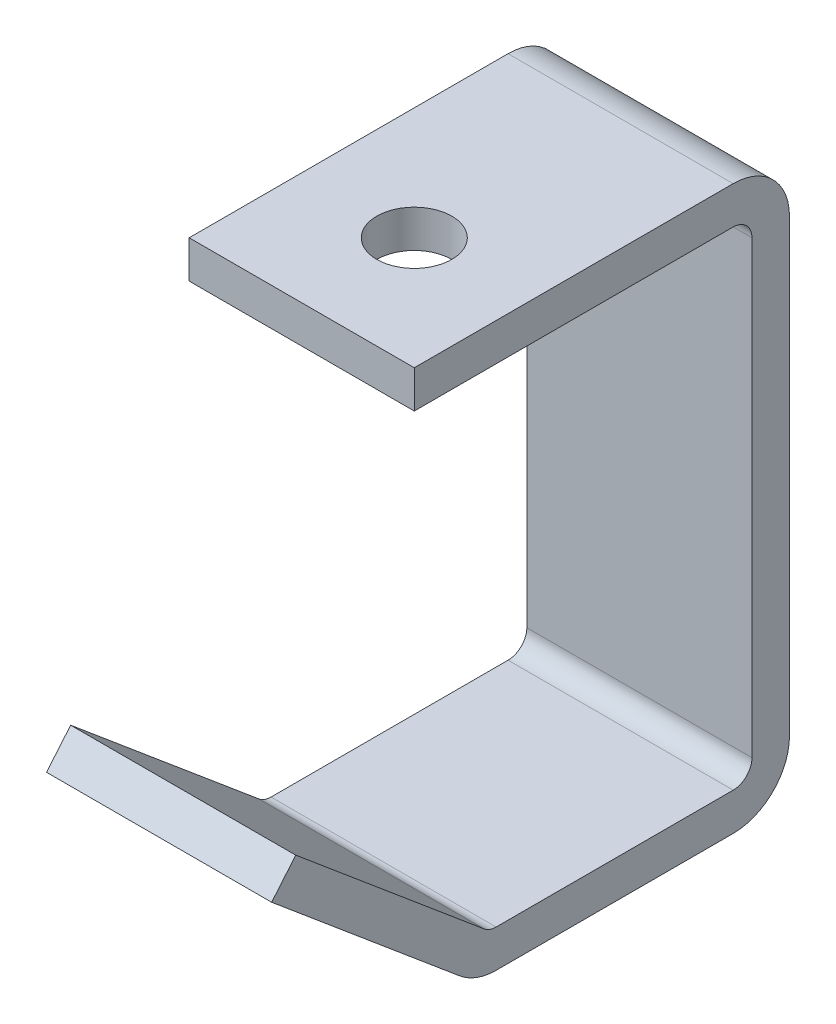
ISO-10303-21;
HEADER;
FILE_DESCRIPTION(('STEP AP214'),'2;1');
FILE_NAME('part.step','',(''),(''),'','','');
FILE_SCHEMA(('AUTOMOTIVE_DESIGN { 1 0 10303 214 1 1 1 1 }'));
ENDSEC;
DATA;
#1=APPLICATION_CONTEXT('core data for automotive mechanical design processes');
#2=APPLICATION_PROTOCOL_DEFINITION('international standard','automotive_design',2000,#1);
#3=PRODUCT_CONTEXT('',#1,'mechanical');
#4=PRODUCT('Part','Part','',(#3));
#5=PRODUCT_RELATED_PRODUCT_CATEGORY('part','',(#4));
#6=PRODUCT_DEFINITION_FORMATION('','',#4);
#7=PRODUCT_DEFINITION_CONTEXT('part definition',#1,'design');
#8=PRODUCT_DEFINITION('design','',#6,#7);
#9=PRODUCT_DEFINITION_SHAPE('','',#8);
#10=(LENGTH_UNIT() NAMED_UNIT(*) SI_UNIT(.MILLI.,.METRE.));
#11=(NAMED_UNIT(*) PLANE_ANGLE_UNIT() SI_UNIT($,.RADIAN.));
#12=(NAMED_UNIT(*) SI_UNIT($,.STERADIAN.) SOLID_ANGLE_UNIT());
#13=UNCERTAINTY_MEASURE_WITH_UNIT(LENGTH_MEASURE(1.E-05),#10,'distance_accuracy_value','');
#14=(GEOMETRIC_REPRESENTATION_CONTEXT(3) GLOBAL_UNCERTAINTY_ASSIGNED_CONTEXT((#13)) GLOBAL_UNIT_ASSIGNED_CONTEXT((#10,
#11,#12)) REPRESENTATION_CONTEXT('',''));
#15=CARTESIAN_POINT('',(0.,0.,0.));
#16=DIRECTION('',(0.,0.,1.));
#17=DIRECTION('',(1.,0.,0.));
#18=AXIS2_PLACEMENT_3D('',#15,#16,#17);
#19=CARTESIAN_POINT('',(19.05,82.55,57.15));
#20=DIRECTION('',(0.,0.,-1.));
#21=DIRECTION('',(0.,1.,0.));
#22=AXIS2_PLACEMENT_3D('',#19,#20,#21);
#23=PLANE('',#22);
#24=DIRECTION('',(-1.,0.,0.));
#25=VECTOR('',#24,1.);
#26=CARTESIAN_POINT('',(19.05,82.55,57.15));
#27=LINE('',#26,#25);
#28=CARTESIAN_POINT('',(19.05,82.55,57.15));
#29=VERTEX_POINT('',#28);
#30=CARTESIAN_POINT('',(-19.05,82.55,57.15));
#31=VERTEX_POINT('',#30);
#32=EDGE_CURVE('E168',#29,#31,#27,.T.);
#33=ORIENTED_EDGE('',*,*,#32,.F.);
#34=DIRECTION('',(0.,-1.,0.));
#35=VECTOR('',#34,1.);
#36=CARTESIAN_POINT('',(19.05,82.55,57.15));
#37=LINE('',#36,#35);
#38=CARTESIAN_POINT('',(19.05,88.9,57.15));
#39=VERTEX_POINT('',#38);
#40=EDGE_CURVE('E186',#39,#29,#37,.T.);
#41=ORIENTED_EDGE('',*,*,#40,.F.);
#42=DIRECTION('',(-1.,0.,0.));
#43=VECTOR('',#42,1.);
#44=CARTESIAN_POINT('',(19.05,88.9,57.15));
#45=LINE('',#44,#43);
#46=CARTESIAN_POINT('',(-19.05,88.9,57.15));
#47=VERTEX_POINT('',#46);
#48=EDGE_CURVE('E198',#39,#47,#45,.T.);
#49=ORIENTED_EDGE('',*,*,#48,.T.);
#50=DIRECTION('',(0.,-1.,0.));
#51=VECTOR('',#50,1.);
#52=CARTESIAN_POINT('',(-19.05,82.55,57.15));
#53=LINE('',#52,#51);
#54=EDGE_CURVE('E176',#47,#31,#53,.T.);
#55=ORIENTED_EDGE('',*,*,#54,.T.);
#56=EDGE_LOOP('',(#33,#41,#49,#55));
#57=FACE_BOUND('',#56,.T.);
#58=ADVANCED_FACE('F33',(#57),#23,.F.);
#59=CARTESIAN_POINT('',(19.05,27.488043347538,77.2089744128137));
#60=DIRECTION('',(0.,0.64278760968654,0.766044443118977));
#61=DIRECTION('',(0.,-0.766044443118977,0.64278760968654));
#62=AXIS2_PLACEMENT_3D('',#59,#60,#61);
#63=PLANE('',#62);
#64=DIRECTION('',(0.,0.766044443118977,-0.64278760968654));
#65=VECTOR('',#64,1.);
#66=CARTESIAN_POINT('',(19.05,27.488043347538,77.2089744128137));
#67=LINE('',#66,#65);
#68=CARTESIAN_POINT('',(19.05,22.6236611337325,81.2906757343232));
#69=VERTEX_POINT('',#68);
#70=CARTESIAN_POINT('',(19.05,27.488043347538,77.2089744128137));
#71=VERTEX_POINT('',#70);
#72=EDGE_CURVE('E167',#69,#71,#67,.T.);
#73=ORIENTED_EDGE('',*,*,#72,.T.);
#74=DIRECTION('',(-1.,0.,0.));
#75=VECTOR('',#74,1.);
#76=CARTESIAN_POINT('',(19.05,27.488043347538,77.2089744128137));
#77=LINE('',#76,#75);
#78=CARTESIAN_POINT('',(-19.05,27.488043347538,77.2089744128137));
#79=VERTEX_POINT('',#78);
#80=EDGE_CURVE('E152',#71,#79,#77,.T.);
#81=ORIENTED_EDGE('',*,*,#80,.T.);
#82=DIRECTION('',(0.,0.766044443118977,-0.64278760968654));
#83=VECTOR('',#82,1.);
#84=CARTESIAN_POINT('',(-19.05,27.488043347538,77.2089744128137));
#85=LINE('',#84,#83);
#86=CARTESIAN_POINT('',(-19.05,22.6236611337325,81.2906757343232));
#87=VERTEX_POINT('',#86);
#88=EDGE_CURVE('E165',#87,#79,#85,.T.);
#89=ORIENTED_EDGE('',*,*,#88,.F.);
#90=DIRECTION('',(-1.,0.,0.));
#91=VECTOR('',#90,1.);
#92=CARTESIAN_POINT('',(19.05,22.6236611337325,81.2906757343232));
#93=LINE('',#92,#91);
#94=EDGE_CURVE('E196',#69,#87,#93,.T.);
#95=ORIENTED_EDGE('',*,*,#94,.F.);
#96=EDGE_LOOP('',(#73,#81,#89,#95));
#97=FACE_BOUND('',#96,.T.);
#98=ADVANCED_FACE('F164',(#97),#63,.T.);
#99=CARTESIAN_POINT('',(19.05,0.,0.));
#100=DIRECTION('',(1.,0.,0.));
#101=DIRECTION('',(0.,0.,-1.));
#102=AXIS2_PLACEMENT_3D('',#99,#100,#101);
#103=PLANE('',#102);
#104=DIRECTION('',(0.,-0.64278760968654,-0.766044443118977));
#105=VECTOR('',#104,1.);
#106=CARTESIAN_POINT('',(19.05,22.6236611337325,81.2906757343232));
#107=LINE('',#106,#105);
#108=CARTESIAN_POINT('',(19.05,-4.12157332070826,49.4169464884691));
#109=VERTEX_POINT('',#108);
#110=EDGE_CURVE('E187',#69,#109,#107,.T.);
#111=ORIENTED_EDGE('',*,*,#110,.T.);
#112=CARTESIAN_POINT('',(19.05,3.175,43.2943945062048));
#113=DIRECTION('',(1.,0.,0.));
#114=DIRECTION('',(0.,0.,-1.));
#115=AXIS2_PLACEMENT_3D('',#112,#113,#114);
#116=CIRCLE('',#115,9.525);
#117=CARTESIAN_POINT('',(19.05,-6.35,43.2943945062048));
#118=VERTEX_POINT('',#117);
#119=EDGE_CURVE('E249',#109,#118,#116,.T.);
#120=ORIENTED_EDGE('',*,*,#119,.T.);
#121=DIRECTION('',(0.,0.,-1.));
#122=VECTOR('',#121,1.);
#123=CARTESIAN_POINT('',(19.05,-6.35,44.45));
#124=LINE('',#123,#122);
#125=CARTESIAN_POINT('',(19.05,-6.35,3.175));
#126=VERTEX_POINT('',#125);
#127=EDGE_CURVE('E201',#118,#126,#124,.T.);
#128=ORIENTED_EDGE('',*,*,#127,.T.);
#129=CARTESIAN_POINT('',(19.05,3.17500000000001,3.175));
#130=DIRECTION('',(1.,0.,0.));
#131=DIRECTION('',(0.,0.,-1.));
#132=AXIS2_PLACEMENT_3D('',#129,#130,#131);
#133=CIRCLE('',#132,9.525);
#134=CARTESIAN_POINT('',(19.05,3.17500000000001,-6.35));
#135=VERTEX_POINT('',#134);
#136=EDGE_CURVE('E54',#126,#135,#133,.T.);
#137=ORIENTED_EDGE('',*,*,#136,.T.);
#138=DIRECTION('',(0.,-1.,0.));
#139=VECTOR('',#138,1.);
#140=CARTESIAN_POINT('',(19.05,82.55,-6.35));
#141=LINE('',#140,#139);
#142=CARTESIAN_POINT('',(19.05,79.375,-6.35));
#143=VERTEX_POINT('',#142);
#144=EDGE_CURVE('E203',#143,#135,#141,.T.);
#145=ORIENTED_EDGE('',*,*,#144,.F.);
#146=CARTESIAN_POINT('',(19.05,79.375,3.175));
#147=DIRECTION('',(1.,0.,0.));
#148=DIRECTION('',(0.,0.,-1.));
#149=AXIS2_PLACEMENT_3D('',#146,#147,#148);
#150=CIRCLE('',#149,9.525);
#151=CARTESIAN_POINT('',(19.05,88.9,3.175));
#152=VERTEX_POINT('',#151);
#153=EDGE_CURVE('E48',#143,#152,#150,.T.);
#154=ORIENTED_EDGE('',*,*,#153,.T.);
#155=DIRECTION('',(0.,0.,-1.));
#156=VECTOR('',#155,1.);
#157=CARTESIAN_POINT('',(19.05,88.9,57.15));
#158=LINE('',#157,#156);
#159=EDGE_CURVE('E190',#39,#152,#158,.T.);
#160=ORIENTED_EDGE('',*,*,#159,.F.);
#161=ORIENTED_EDGE('',*,*,#40,.T.);
#162=DIRECTION('',(0.,0.,-1.));
#163=VECTOR('',#162,1.);
#164=CARTESIAN_POINT('',(19.05,82.55,57.15));
#165=LINE('',#164,#163);
#166=CARTESIAN_POINT('',(19.05,82.55,3.175));
#167=VERTEX_POINT('',#166);
#168=EDGE_CURVE('E169',#29,#167,#165,.T.);
#169=ORIENTED_EDGE('',*,*,#168,.T.);
#170=CARTESIAN_POINT('',(19.05,79.375,3.175));
#171=DIRECTION('',(1.,0.,0.));
#172=DIRECTION('',(0.,0.,-1.));
#173=AXIS2_PLACEMENT_3D('',#170,#171,#172);
#174=CIRCLE('',#173,3.175);
#175=CARTESIAN_POINT('',(19.05,79.375,0.));
#176=VERTEX_POINT('',#175);
#177=EDGE_CURVE('E232',#167,#176,#174,.F.);
#178=ORIENTED_EDGE('',*,*,#177,.T.);
#179=DIRECTION('',(0.,-1.,0.));
#180=VECTOR('',#179,1.);
#181=CARTESIAN_POINT('',(19.05,82.55,0.));
#182=LINE('',#181,#180);
#183=CARTESIAN_POINT('',(19.05,3.175,0.));
#184=VERTEX_POINT('',#183);
#185=EDGE_CURVE('E282',#176,#184,#182,.T.);
#186=ORIENTED_EDGE('',*,*,#185,.T.);
#187=CARTESIAN_POINT('',(19.05,3.175,3.175));
#188=DIRECTION('',(1.,0.,0.));
#189=DIRECTION('',(0.,0.,-1.));
#190=AXIS2_PLACEMENT_3D('',#187,#188,#189);
#191=CIRCLE('',#190,3.175);
#192=CARTESIAN_POINT('',(19.05,0.,3.175));
#193=VERTEX_POINT('',#192);
#194=EDGE_CURVE('E228',#184,#193,#191,.F.);
#195=ORIENTED_EDGE('',*,*,#194,.T.);
#196=DIRECTION('',(0.,0.,-1.));
#197=VECTOR('',#196,1.);
#198=CARTESIAN_POINT('',(19.05,0.,44.45));
#199=LINE('',#198,#197);
#200=CARTESIAN_POINT('',(19.05,0.,43.2943945062048));
#201=VERTEX_POINT('',#200);
#202=EDGE_CURVE('E279',#201,#193,#199,.T.);
#203=ORIENTED_EDGE('',*,*,#202,.F.);
#204=CARTESIAN_POINT('',(19.05,3.175,43.2943945062048));
#205=DIRECTION('',(1.,0.,0.));
#206=DIRECTION('',(0.,0.,-1.));
#207=AXIS2_PLACEMENT_3D('',#204,#205,#206);
#208=CIRCLE('',#207,3.175);
#209=CARTESIAN_POINT('',(19.05,0.74280889309725,45.3352451669596));
#210=VERTEX_POINT('',#209);
#211=EDGE_CURVE('E224',#201,#210,#208,.F.);
#212=ORIENTED_EDGE('',*,*,#211,.T.);
#213=DIRECTION('',(0.,-0.64278760968654,-0.766044443118977));
#214=VECTOR('',#213,1.);
#215=CARTESIAN_POINT('',(19.05,27.488043347538,77.2089744128137));
#216=LINE('',#215,#214);
#217=EDGE_CURVE('E277',#71,#210,#216,.T.);
#218=ORIENTED_EDGE('',*,*,#217,.F.);
#219=ORIENTED_EDGE('',*,*,#72,.F.);
#220=EDGE_LOOP('',(#111,#120,#128,#137,#145,#154,#160,#161,#169,#178,#186,#195,#203,#212,#218,#219));
#221=FACE_BOUND('',#220,.T.);
#222=ADVANCED_FACE('F267',(#221),#103,.T.);
#223=CARTESIAN_POINT('',(19.05,82.55,-6.35));
#224=DIRECTION('',(0.,0.,-1.));
#225=DIRECTION('',(0.,1.,0.));
#226=AXIS2_PLACEMENT_3D('',#223,#224,#225);
#227=PLANE('',#226);
#228=ORIENTED_EDGE('',*,*,#144,.T.);
#229=DIRECTION('',(-1.,0.,0.));
#230=VECTOR('',#229,1.);
#231=CARTESIAN_POINT('',(-19.05,3.17500000000001,-6.35));
#232=LINE('',#231,#230);
#233=CARTESIAN_POINT('',(-19.05,3.17500000000001,-6.35));
#234=VERTEX_POINT('',#233);
#235=EDGE_CURVE('E41',#135,#234,#232,.T.);
#236=ORIENTED_EDGE('',*,*,#235,.T.);
#237=DIRECTION('',(0.,-1.,0.));
#238=VECTOR('',#237,1.);
#239=CARTESIAN_POINT('',(-19.05,82.55,-6.35));
#240=LINE('',#239,#238);
#241=CARTESIAN_POINT('',(-19.05,79.375,-6.35));
#242=VERTEX_POINT('',#241);
#243=EDGE_CURVE('E191',#242,#234,#240,.T.);
#244=ORIENTED_EDGE('',*,*,#243,.F.);
#245=DIRECTION('',(-1.,0.,0.));
#246=VECTOR('',#245,1.);
#247=CARTESIAN_POINT('',(19.05,79.375,-6.35));
#248=LINE('',#247,#246);
#249=EDGE_CURVE('E251',#242,#143,#248,.F.);
#250=ORIENTED_EDGE('',*,*,#249,.T.);
#251=EDGE_LOOP('',(#228,#236,#244,#250));
#252=FACE_BOUND('',#251,.T.);
#253=ADVANCED_FACE('F256',(#252),#227,.T.);
#254=CARTESIAN_POINT('',(19.05,88.9,57.15));
#255=DIRECTION('',(0.,1.,0.));
#256=DIRECTION('',(0.,0.,1.));
#257=AXIS2_PLACEMENT_3D('',#254,#255,#256);
#258=PLANE('',#257);
#259=CARTESIAN_POINT('',(0.,88.9,38.1));
#260=DIRECTION('',(0.,1.,0.));
#261=DIRECTION('',(0.,0.,1.));
#262=AXIS2_PLACEMENT_3D('',#259,#260,#261);
#263=CIRCLE('',#262,6.35);
#264=CARTESIAN_POINT('',(0.,88.9,44.45));
#265=VERTEX_POINT('',#264);
#266=EDGE_CURVE('E292',#265,#265,#263,.T.);
#267=ORIENTED_EDGE('',*,*,#266,.F.);
#268=EDGE_LOOP('',(#267));
#269=FACE_BOUND('',#268,.T.);
#270=ORIENTED_EDGE('',*,*,#159,.T.);
#271=DIRECTION('',(-1.,0.,0.));
#272=VECTOR('',#271,1.);
#273=CARTESIAN_POINT('',(19.05,88.9,3.175));
#274=LINE('',#273,#272);
#275=CARTESIAN_POINT('',(-19.05,88.9,3.175));
#276=VERTEX_POINT('',#275);
#277=EDGE_CURVE('E11',#152,#276,#274,.T.);
#278=ORIENTED_EDGE('',*,*,#277,.T.);
#279=DIRECTION('',(0.,0.,-1.));
#280=VECTOR('',#279,1.);
#281=CARTESIAN_POINT('',(-19.05,88.9,57.15));
#282=LINE('',#281,#280);
#283=EDGE_CURVE('E179',#47,#276,#282,.T.);
#284=ORIENTED_EDGE('',*,*,#283,.F.);
#285=ORIENTED_EDGE('',*,*,#48,.F.);
#286=EDGE_LOOP('',(#270,#278,#284,#285));
#287=FACE_BOUND('',#286,.T.);
#288=ADVANCED_FACE('F265',(#269,#287),#258,.T.);
#289=CARTESIAN_POINT('',(19.05,22.6236611337325,81.2906757343232));
#290=DIRECTION('',(0.,0.766044443118977,-0.642787609686541));
#291=DIRECTION('',(0.,0.64278760968654,0.766044443118977));
#292=AXIS2_PLACEMENT_3D('',#289,#290,#291);
#293=PLANE('',#292);
#294=DIRECTION('',(0.,-0.64278760968654,-0.766044443118977));
#295=VECTOR('',#294,1.);
#296=CARTESIAN_POINT('',(-19.05,22.6236611337325,81.2906757343232));
#297=LINE('',#296,#295);
#298=CARTESIAN_POINT('',(-19.05,-4.12157332070826,49.4169464884691));
#299=VERTEX_POINT('',#298);
#300=EDGE_CURVE('E175',#87,#299,#297,.T.);
#301=ORIENTED_EDGE('',*,*,#300,.T.);
#302=DIRECTION('',(-1.,0.,0.));
#303=VECTOR('',#302,1.);
#304=CARTESIAN_POINT('',(19.05,-4.12157332070826,49.4169464884691));
#305=LINE('',#304,#303);
#306=EDGE_CURVE('E245',#299,#109,#305,.F.);
#307=ORIENTED_EDGE('',*,*,#306,.T.);
#308=ORIENTED_EDGE('',*,*,#110,.F.);
#309=ORIENTED_EDGE('',*,*,#94,.T.);
#310=EDGE_LOOP('',(#301,#307,#308,#309));
#311=FACE_BOUND('',#310,.T.);
#312=ADVANCED_FACE('F334',(#311),#293,.F.);
#313=CARTESIAN_POINT('',(19.05,-6.35,44.45));
#314=DIRECTION('',(0.,1.,0.));
#315=DIRECTION('',(0.,0.,1.));
#316=AXIS2_PLACEMENT_3D('',#313,#314,#315);
#317=PLANE('',#316);
#318=ORIENTED_EDGE('',*,*,#127,.F.);
#319=DIRECTION('',(-1.,0.,0.));
#320=VECTOR('',#319,1.);
#321=CARTESIAN_POINT('',(19.05,-6.35,43.2943945062048));
#322=LINE('',#321,#320);
#323=CARTESIAN_POINT('',(-19.05,-6.35,43.2943945062048));
#324=VERTEX_POINT('',#323);
#325=EDGE_CURVE('E236',#118,#324,#322,.T.);
#326=ORIENTED_EDGE('',*,*,#325,.T.);
#327=DIRECTION('',(0.,0.,-1.));
#328=VECTOR('',#327,1.);
#329=CARTESIAN_POINT('',(-19.05,-6.35,44.45));
#330=LINE('',#329,#328);
#331=CARTESIAN_POINT('',(-19.05,-6.35,3.175));
#332=VERTEX_POINT('',#331);
#333=EDGE_CURVE('E181',#324,#332,#330,.T.);
#334=ORIENTED_EDGE('',*,*,#333,.T.);
#335=DIRECTION('',(-1.,0.,0.));
#336=VECTOR('',#335,1.);
#337=CARTESIAN_POINT('',(19.05,-6.35,3.175));
#338=LINE('',#337,#336);
#339=EDGE_CURVE('E234',#332,#126,#338,.F.);
#340=ORIENTED_EDGE('',*,*,#339,.T.);
#341=EDGE_LOOP('',(#318,#326,#334,#340));
#342=FACE_BOUND('',#341,.T.);
#343=ADVANCED_FACE('F35',(#342),#317,.F.);
#344=CARTESIAN_POINT('',(-19.05,0.,0.));
#345=DIRECTION('',(1.,0.,0.));
#346=DIRECTION('',(0.,0.,-1.));
#347=AXIS2_PLACEMENT_3D('',#344,#345,#346);
#348=PLANE('',#347);
#349=ORIENTED_EDGE('',*,*,#333,.F.);
#350=CARTESIAN_POINT('',(-19.05,3.175,43.2943945062048));
#351=DIRECTION('',(1.,0.,0.));
#352=DIRECTION('',(0.,0.,-1.));
#353=AXIS2_PLACEMENT_3D('',#350,#351,#352);
#354=CIRCLE('',#353,9.525);
#355=EDGE_CURVE('E243',#324,#299,#354,.F.);
#356=ORIENTED_EDGE('',*,*,#355,.T.);
#357=ORIENTED_EDGE('',*,*,#300,.F.);
#358=ORIENTED_EDGE('',*,*,#88,.T.);
#359=DIRECTION('',(0.,-0.64278760968654,-0.766044443118977));
#360=VECTOR('',#359,1.);
#361=CARTESIAN_POINT('',(-19.05,27.488043347538,77.2089744128137));
#362=LINE('',#361,#360);
#363=CARTESIAN_POINT('',(-19.05,0.74280889309725,45.3352451669596));
#364=VERTEX_POINT('',#363);
#365=EDGE_CURVE('E148',#79,#364,#362,.T.);
#366=ORIENTED_EDGE('',*,*,#365,.T.);
#367=CARTESIAN_POINT('',(-19.05,3.175,43.2943945062048));
#368=DIRECTION('',(1.,0.,0.));
#369=DIRECTION('',(0.,0.,-1.));
#370=AXIS2_PLACEMENT_3D('',#367,#368,#369);
#371=CIRCLE('',#370,3.175);
#372=CARTESIAN_POINT('',(-19.05,0.,43.2943945062048));
#373=VERTEX_POINT('',#372);
#374=EDGE_CURVE('E222',#364,#373,#371,.T.);
#375=ORIENTED_EDGE('',*,*,#374,.T.);
#376=DIRECTION('',(0.,0.,-1.));
#377=VECTOR('',#376,1.);
#378=CARTESIAN_POINT('',(-19.05,0.,44.45));
#379=LINE('',#378,#377);
#380=CARTESIAN_POINT('',(-19.05,0.,3.175));
#381=VERTEX_POINT('',#380);
#382=EDGE_CURVE('E159',#373,#381,#379,.T.);
#383=ORIENTED_EDGE('',*,*,#382,.T.);
#384=CARTESIAN_POINT('',(-19.05,3.175,3.175));
#385=DIRECTION('',(1.,0.,0.));
#386=DIRECTION('',(0.,0.,-1.));
#387=AXIS2_PLACEMENT_3D('',#384,#385,#386);
#388=CIRCLE('',#387,3.175);
#389=CARTESIAN_POINT('',(-19.05,3.175,0.));
#390=VERTEX_POINT('',#389);
#391=EDGE_CURVE('E226',#381,#390,#388,.T.);
#392=ORIENTED_EDGE('',*,*,#391,.T.);
#393=DIRECTION('',(0.,-1.,0.));
#394=VECTOR('',#393,1.);
#395=CARTESIAN_POINT('',(-19.05,82.55,0.));
#396=LINE('',#395,#394);
#397=CARTESIAN_POINT('',(-19.05,79.375,0.));
#398=VERTEX_POINT('',#397);
#399=EDGE_CURVE('E288',#398,#390,#396,.T.);
#400=ORIENTED_EDGE('',*,*,#399,.F.);
#401=CARTESIAN_POINT('',(-19.05,79.375,3.175));
#402=DIRECTION('',(1.,0.,0.));
#403=DIRECTION('',(0.,0.,-1.));
#404=AXIS2_PLACEMENT_3D('',#401,#402,#403);
#405=CIRCLE('',#404,3.175);
#406=CARTESIAN_POINT('',(-19.05,82.55,3.175));
#407=VERTEX_POINT('',#406);
#408=EDGE_CURVE('E230',#398,#407,#405,.T.);
#409=ORIENTED_EDGE('',*,*,#408,.T.);
#410=DIRECTION('',(0.,0.,-1.));
#411=VECTOR('',#410,1.);
#412=CARTESIAN_POINT('',(-19.05,82.55,57.15));
#413=LINE('',#412,#411);
#414=EDGE_CURVE('E158',#31,#407,#413,.T.);
#415=ORIENTED_EDGE('',*,*,#414,.F.);
#416=ORIENTED_EDGE('',*,*,#54,.F.);
#417=ORIENTED_EDGE('',*,*,#283,.T.);
#418=CARTESIAN_POINT('',(-19.05,79.375,3.175));
#419=DIRECTION('',(1.,0.,0.));
#420=DIRECTION('',(0.,0.,-1.));
#421=AXIS2_PLACEMENT_3D('',#418,#419,#420);
#422=CIRCLE('',#421,9.525);
#423=EDGE_CURVE('E239',#276,#242,#422,.F.);
#424=ORIENTED_EDGE('',*,*,#423,.T.);
#425=ORIENTED_EDGE('',*,*,#243,.T.);
#426=CARTESIAN_POINT('',(-19.05,3.17500000000001,3.175));
#427=DIRECTION('',(1.,0.,0.));
#428=DIRECTION('',(0.,0.,-1.));
#429=AXIS2_PLACEMENT_3D('',#426,#427,#428);
#430=CIRCLE('',#429,9.525);
#431=EDGE_CURVE('E241',#234,#332,#430,.F.);
#432=ORIENTED_EDGE('',*,*,#431,.T.);
#433=EDGE_LOOP('',(#349,#356,#357,#358,#366,#375,#383,#392,#400,#409,#415,#416,#417,#424,#425,#432));
#434=FACE_BOUND('',#433,.T.);
#435=ADVANCED_FACE('F173',(#434),#348,.F.);
#436=CARTESIAN_POINT('',(19.05,82.55,0.));
#437=DIRECTION('',(0.,0.,-1.));
#438=DIRECTION('',(0.,1.,0.));
#439=AXIS2_PLACEMENT_3D('',#436,#437,#438);
#440=PLANE('',#439);
#441=ORIENTED_EDGE('',*,*,#399,.T.);
#442=DIRECTION('',(-1.,0.,0.));
#443=VECTOR('',#442,1.);
#444=CARTESIAN_POINT('',(19.05,3.175,0.));
#445=LINE('',#444,#443);
#446=EDGE_CURVE('E218',#390,#184,#445,.F.);
#447=ORIENTED_EDGE('',*,*,#446,.T.);
#448=ORIENTED_EDGE('',*,*,#185,.F.);
#449=DIRECTION('',(-1.,0.,0.));
#450=VECTOR('',#449,1.);
#451=CARTESIAN_POINT('',(-19.05,79.375,0.));
#452=LINE('',#451,#450);
#453=EDGE_CURVE('E215',#176,#398,#452,.T.);
#454=ORIENTED_EDGE('',*,*,#453,.T.);
#455=EDGE_LOOP('',(#441,#447,#448,#454));
#456=FACE_BOUND('',#455,.T.);
#457=ADVANCED_FACE('F302',(#456),#440,.F.);
#458=CARTESIAN_POINT('',(19.05,82.55,57.15));
#459=DIRECTION('',(0.,1.,0.));
#460=DIRECTION('',(0.,0.,1.));
#461=AXIS2_PLACEMENT_3D('',#458,#459,#460);
#462=PLANE('',#461);
#463=CARTESIAN_POINT('',(0.,82.55,38.1));
#464=DIRECTION('',(0.,1.,0.));
#465=DIRECTION('',(0.,0.,1.));
#466=AXIS2_PLACEMENT_3D('',#463,#464,#465);
#467=CIRCLE('',#466,6.35);
#468=CARTESIAN_POINT('',(0.,82.55,44.45));
#469=VERTEX_POINT('',#468);
#470=EDGE_CURVE('E291',#469,#469,#467,.F.);
#471=ORIENTED_EDGE('',*,*,#470,.F.);
#472=EDGE_LOOP('',(#471));
#473=FACE_BOUND('',#472,.T.);
#474=ORIENTED_EDGE('',*,*,#414,.T.);
#475=DIRECTION('',(-1.,0.,0.));
#476=VECTOR('',#475,1.);
#477=CARTESIAN_POINT('',(19.05,82.55,3.175));
#478=LINE('',#477,#476);
#479=EDGE_CURVE('E220',#407,#167,#478,.F.);
#480=ORIENTED_EDGE('',*,*,#479,.T.);
#481=ORIENTED_EDGE('',*,*,#168,.F.);
#482=ORIENTED_EDGE('',*,*,#32,.T.);
#483=EDGE_LOOP('',(#474,#480,#481,#482));
#484=FACE_BOUND('',#483,.T.);
#485=ADVANCED_FACE('F300',(#473,#484),#462,.F.);
#486=CARTESIAN_POINT('',(19.05,27.488043347538,77.2089744128137));
#487=DIRECTION('',(0.,0.766044443118977,-0.642787609686541));
#488=DIRECTION('',(0.,0.64278760968654,0.766044443118977));
#489=AXIS2_PLACEMENT_3D('',#486,#487,#488);
#490=PLANE('',#489);
#491=ORIENTED_EDGE('',*,*,#217,.T.);
#492=DIRECTION('',(-1.,0.,0.));
#493=VECTOR('',#492,1.);
#494=CARTESIAN_POINT('',(-19.05,0.742808893097247,45.3352451669596));
#495=LINE('',#494,#493);
#496=EDGE_CURVE('E155',#210,#364,#495,.T.);
#497=ORIENTED_EDGE('',*,*,#496,.T.);
#498=ORIENTED_EDGE('',*,*,#365,.F.);
#499=ORIENTED_EDGE('',*,*,#80,.F.);
#500=EDGE_LOOP('',(#491,#497,#498,#499));
#501=FACE_BOUND('',#500,.T.);
#502=ADVANCED_FACE('F151',(#501),#490,.T.);
#503=CARTESIAN_POINT('',(19.05,0.,44.45));
#504=DIRECTION('',(0.,1.,0.));
#505=DIRECTION('',(0.,0.,1.));
#506=AXIS2_PLACEMENT_3D('',#503,#504,#505);
#507=PLANE('',#506);
#508=ORIENTED_EDGE('',*,*,#382,.F.);
#509=DIRECTION('',(-1.,0.,0.));
#510=VECTOR('',#509,1.);
#511=CARTESIAN_POINT('',(19.05,0.,43.2943945062048));
#512=LINE('',#511,#510);
#513=EDGE_CURVE('E213',#373,#201,#512,.F.);
#514=ORIENTED_EDGE('',*,*,#513,.T.);
#515=ORIENTED_EDGE('',*,*,#202,.T.);
#516=DIRECTION('',(-1.,0.,0.));
#517=VECTOR('',#516,1.);
#518=CARTESIAN_POINT('',(19.05,0.,3.175));
#519=LINE('',#518,#517);
#520=EDGE_CURVE('E210',#193,#381,#519,.T.);
#521=ORIENTED_EDGE('',*,*,#520,.T.);
#522=EDGE_LOOP('',(#508,#514,#515,#521));
#523=FACE_BOUND('',#522,.T.);
#524=ADVANCED_FACE('F320',(#523),#507,.T.);
#525=CARTESIAN_POINT('',(19.05,3.175,43.2943945062048));
#526=DIRECTION('',(1.,0.,0.));
#527=DIRECTION('',(0.,0.,-1.));
#528=AXIS2_PLACEMENT_3D('',#525,#526,#527);
#529=CYLINDRICAL_SURFACE('',#528,3.175);
#530=ORIENTED_EDGE('',*,*,#211,.F.);
#531=ORIENTED_EDGE('',*,*,#513,.F.);
#532=ORIENTED_EDGE('',*,*,#374,.F.);
#533=ORIENTED_EDGE('',*,*,#496,.F.);
#534=EDGE_LOOP('',(#530,#531,#532,#533));
#535=FACE_BOUND('',#534,.T.);
#536=ADVANCED_FACE('F323',(#535),#529,.F.);
#537=CARTESIAN_POINT('',(19.05,3.175,3.175));
#538=DIRECTION('',(-1.,0.,0.));
#539=DIRECTION('',(0.,0.,1.));
#540=AXIS2_PLACEMENT_3D('',#537,#538,#539);
#541=CYLINDRICAL_SURFACE('',#540,3.175);
#542=ORIENTED_EDGE('',*,*,#194,.F.);
#543=ORIENTED_EDGE('',*,*,#446,.F.);
#544=ORIENTED_EDGE('',*,*,#391,.F.);
#545=ORIENTED_EDGE('',*,*,#520,.F.);
#546=EDGE_LOOP('',(#542,#543,#544,#545));
#547=FACE_BOUND('',#546,.T.);
#548=ADVANCED_FACE('F314',(#547),#541,.F.);
#549=CARTESIAN_POINT('',(19.05,79.375,3.175));
#550=DIRECTION('',(1.,0.,0.));
#551=DIRECTION('',(0.,0.,-1.));
#552=AXIS2_PLACEMENT_3D('',#549,#550,#551);
#553=CYLINDRICAL_SURFACE('',#552,3.175);
#554=ORIENTED_EDGE('',*,*,#177,.F.);
#555=ORIENTED_EDGE('',*,*,#479,.F.);
#556=ORIENTED_EDGE('',*,*,#408,.F.);
#557=ORIENTED_EDGE('',*,*,#453,.F.);
#558=EDGE_LOOP('',(#554,#555,#556,#557));
#559=FACE_BOUND('',#558,.T.);
#560=ADVANCED_FACE('F306',(#559),#553,.F.);
#561=CARTESIAN_POINT('',(19.05,3.175,43.2943945062048));
#562=DIRECTION('',(-1.,0.,0.));
#563=DIRECTION('',(0.,0.,1.));
#564=AXIS2_PLACEMENT_3D('',#561,#562,#563);
#565=CYLINDRICAL_SURFACE('',#564,9.525);
#566=ORIENTED_EDGE('',*,*,#119,.F.);
#567=ORIENTED_EDGE('',*,*,#306,.F.);
#568=ORIENTED_EDGE('',*,*,#355,.F.);
#569=ORIENTED_EDGE('',*,*,#325,.F.);
#570=EDGE_LOOP('',(#566,#567,#568,#569));
#571=FACE_BOUND('',#570,.T.);
#572=ADVANCED_FACE('F331',(#571),#565,.T.);
#573=CARTESIAN_POINT('',(19.05,3.17500000000001,3.175));
#574=DIRECTION('',(1.,0.,0.));
#575=DIRECTION('',(0.,0.,-1.));
#576=AXIS2_PLACEMENT_3D('',#573,#574,#575);
#577=CYLINDRICAL_SURFACE('',#576,9.525);
#578=ORIENTED_EDGE('',*,*,#136,.F.);
#579=ORIENTED_EDGE('',*,*,#339,.F.);
#580=ORIENTED_EDGE('',*,*,#431,.F.);
#581=ORIENTED_EDGE('',*,*,#235,.F.);
#582=EDGE_LOOP('',(#578,#579,#580,#581));
#583=FACE_BOUND('',#582,.T.);
#584=ADVANCED_FACE('F424',(#583),#577,.T.);
#585=CARTESIAN_POINT('',(19.05,79.375,3.175));
#586=DIRECTION('',(-1.,0.,0.));
#587=DIRECTION('',(0.,0.,1.));
#588=AXIS2_PLACEMENT_3D('',#585,#586,#587);
#589=CYLINDRICAL_SURFACE('',#588,9.525);
#590=ORIENTED_EDGE('',*,*,#153,.F.);
#591=ORIENTED_EDGE('',*,*,#249,.F.);
#592=ORIENTED_EDGE('',*,*,#423,.F.);
#593=ORIENTED_EDGE('',*,*,#277,.F.);
#594=EDGE_LOOP('',(#590,#591,#592,#593));
#595=FACE_BOUND('',#594,.T.);
#596=ADVANCED_FACE('F263',(#595),#589,.T.);
#597=CARTESIAN_POINT('',(0.,-6.351,38.1));
#598=DIRECTION('',(0.,1.,0.));
#599=DIRECTION('',(0.,0.,1.));
#600=AXIS2_PLACEMENT_3D('',#597,#598,#599);
#601=CYLINDRICAL_SURFACE('',#600,6.35);
#602=ORIENTED_EDGE('',*,*,#266,.T.);
#603=EDGE_LOOP('',(#602));
#604=FACE_BOUND('',#603,.T.);
#605=ORIENTED_EDGE('',*,*,#470,.T.);
#606=EDGE_LOOP('',(#605));
#607=FACE_BOUND('',#606,.T.);
#608=ADVANCED_FACE('F298',(#604,#607),#601,.F.);
#609=CLOSED_SHELL('',(#58,#98,#222,#253,#288,#312,#343,#435,#457,#485,#502,#524,#536,#548,#560,
#572,#584,#596,#608));
#610=MANIFOLD_SOLID_BREP('B2',#609);
#611=ADVANCED_BREP_SHAPE_REPRESENTATION('',(#18,#610),#14);
#612=SHAPE_DEFINITION_REPRESENTATION(#9,#611);
ENDSEC;
END-ISO-10303-21;
